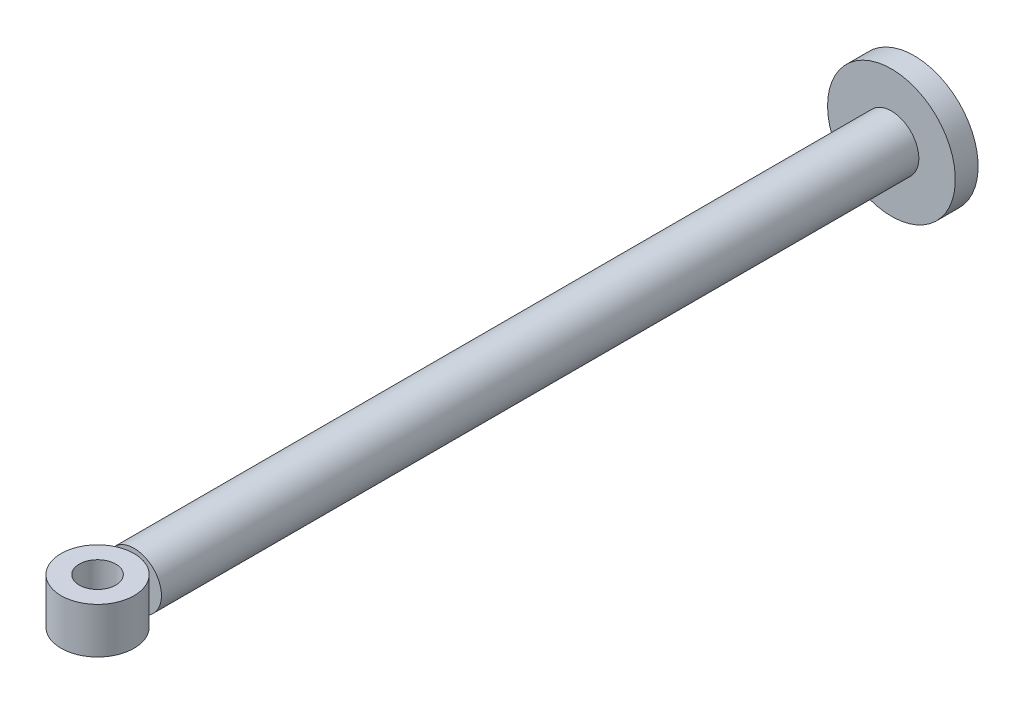
ISO-10303-21;
HEADER;
FILE_DESCRIPTION(('STEP AP214'),'2;1');
FILE_NAME('part.step','',(''),(''),'','','');
FILE_SCHEMA(('AUTOMOTIVE_DESIGN { 1 0 10303 214 1 1 1 1 }'));
ENDSEC;
DATA;
#1=APPLICATION_CONTEXT('core data for automotive mechanical design processes');
#2=APPLICATION_PROTOCOL_DEFINITION('international standard','automotive_design',2000,#1);
#3=PRODUCT_CONTEXT('',#1,'mechanical');
#4=PRODUCT('Part','Part','',(#3));
#5=PRODUCT_RELATED_PRODUCT_CATEGORY('part','',(#4));
#6=PRODUCT_DEFINITION_FORMATION('','',#4);
#7=PRODUCT_DEFINITION_CONTEXT('part definition',#1,'design');
#8=PRODUCT_DEFINITION('design','',#6,#7);
#9=PRODUCT_DEFINITION_SHAPE('','',#8);
#10=(LENGTH_UNIT() NAMED_UNIT(*) SI_UNIT(.MILLI.,.METRE.));
#11=(NAMED_UNIT(*) PLANE_ANGLE_UNIT() SI_UNIT($,.RADIAN.));
#12=(NAMED_UNIT(*) SI_UNIT($,.STERADIAN.) SOLID_ANGLE_UNIT());
#13=UNCERTAINTY_MEASURE_WITH_UNIT(LENGTH_MEASURE(1.E-05),#10,'distance_accuracy_value','');
#14=(GEOMETRIC_REPRESENTATION_CONTEXT(3) GLOBAL_UNCERTAINTY_ASSIGNED_CONTEXT((#13)) GLOBAL_UNIT_ASSIGNED_CONTEXT((#10,
#11,#12)) REPRESENTATION_CONTEXT('',''));
#15=CARTESIAN_POINT('',(0.,0.,0.));
#16=DIRECTION('',(0.,0.,1.));
#17=DIRECTION('',(1.,0.,0.));
#18=AXIS2_PLACEMENT_3D('',#15,#16,#17);
#19=CARTESIAN_POINT('',(0.,-2.5,89.5));
#20=DIRECTION('',(0.,1.,0.));
#21=DIRECTION('',(0.,0.,1.));
#22=AXIS2_PLACEMENT_3D('',#19,#20,#21);
#23=CYLINDRICAL_SURFACE('',#22,4.00000000000001);
#24=CARTESIAN_POINT('',(0.,-2.5,89.5));
#25=DIRECTION('',(0.,1.,0.));
#26=DIRECTION('',(0.,0.,1.));
#27=AXIS2_PLACEMENT_3D('',#24,#25,#26);
#28=CIRCLE('',#27,4.00000000000001);
#29=CARTESIAN_POINT('',(0.,-2.5,93.5));
#30=VERTEX_POINT('',#29);
#31=EDGE_CURVE('E11',#30,#30,#28,.T.);
#32=ORIENTED_EDGE('',*,*,#31,.T.);
#33=EDGE_LOOP('',(#32));
#34=FACE_BOUND('',#33,.T.);
#35=CARTESIAN_POINT('',(0.,2.5,89.5));
#36=DIRECTION('',(0.,1.,0.));
#37=DIRECTION('',(0.,0.,1.));
#38=AXIS2_PLACEMENT_3D('',#35,#36,#37);
#39=CIRCLE('',#38,4.00000000000001);
#40=CARTESIAN_POINT('',(0.,2.5,93.5));
#41=VERTEX_POINT('',#40);
#42=EDGE_CURVE('E55',#41,#41,#39,.T.);
#43=ORIENTED_EDGE('',*,*,#42,.F.);
#44=EDGE_LOOP('',(#43));
#45=FACE_BOUND('',#44,.T.);
#46=ADVANCED_FACE('F45',(#34,#45),#23,.T.);
#47=CARTESIAN_POINT('',(0.,-2.5,89.5));
#48=DIRECTION('',(0.,1.,0.));
#49=DIRECTION('',(0.,0.,1.));
#50=AXIS2_PLACEMENT_3D('',#47,#48,#49);
#51=PLANE('',#50);
#52=CARTESIAN_POINT('',(0.,-2.5,89.5));
#53=DIRECTION('',(0.,1.,0.));
#54=DIRECTION('',(0.,0.,1.));
#55=AXIS2_PLACEMENT_3D('',#52,#53,#54);
#56=CIRCLE('',#55,2.);
#57=CARTESIAN_POINT('',(0.,-2.5,91.5));
#58=VERTEX_POINT('',#57);
#59=EDGE_CURVE('E51',#58,#58,#56,.T.);
#60=ORIENTED_EDGE('',*,*,#59,.T.);
#61=EDGE_LOOP('',(#60));
#62=FACE_BOUND('',#61,.T.);
#63=ORIENTED_EDGE('',*,*,#31,.F.);
#64=EDGE_LOOP('',(#63));
#65=FACE_BOUND('',#64,.T.);
#66=ADVANCED_FACE('F74',(#62,#65),#51,.F.);
#67=CARTESIAN_POINT('',(0.,-2.5,89.5));
#68=DIRECTION('',(0.,1.,0.));
#69=DIRECTION('',(0.,0.,1.));
#70=AXIS2_PLACEMENT_3D('',#67,#68,#69);
#71=CYLINDRICAL_SURFACE('',#70,2.);
#72=ORIENTED_EDGE('',*,*,#59,.F.);
#73=EDGE_LOOP('',(#72));
#74=FACE_BOUND('',#73,.T.);
#75=CARTESIAN_POINT('',(0.,2.5,89.5));
#76=DIRECTION('',(0.,1.,0.));
#77=DIRECTION('',(0.,0.,1.));
#78=AXIS2_PLACEMENT_3D('',#75,#76,#77);
#79=CIRCLE('',#78,2.);
#80=CARTESIAN_POINT('',(0.,2.5,91.5));
#81=VERTEX_POINT('',#80);
#82=EDGE_CURVE('E59',#81,#81,#79,.T.);
#83=ORIENTED_EDGE('',*,*,#82,.T.);
#84=EDGE_LOOP('',(#83));
#85=FACE_BOUND('',#84,.T.);
#86=ADVANCED_FACE('F65',(#74,#85),#71,.F.);
#87=CARTESIAN_POINT('',(0.,2.5,89.5));
#88=DIRECTION('',(0.,1.,0.));
#89=DIRECTION('',(0.,0.,1.));
#90=AXIS2_PLACEMENT_3D('',#87,#88,#89);
#91=PLANE('',#90);
#92=ORIENTED_EDGE('',*,*,#42,.T.);
#93=EDGE_LOOP('',(#92));
#94=FACE_BOUND('',#93,.T.);
#95=ORIENTED_EDGE('',*,*,#82,.F.);
#96=EDGE_LOOP('',(#95));
#97=FACE_BOUND('',#96,.T.);
#98=ADVANCED_FACE('F67',(#94,#97),#91,.T.);
#99=CLOSED_SHELL('',(#46,#66,#86,#98));
#100=MANIFOLD_SOLID_BREP('B2',#99);
#101=CARTESIAN_POINT('',(0.,0.,85.5));
#102=DIRECTION('',(0.,0.,-1.));
#103=DIRECTION('',(-1.,0.,0.));
#104=AXIS2_PLACEMENT_3D('',#101,#102,#103);
#105=CYLINDRICAL_SURFACE('',#104,3.);
#106=CARTESIAN_POINT('',(0.,0.,85.5));
#107=DIRECTION('',(0.,0.,1.));
#108=DIRECTION('',(1.,0.,0.));
#109=AXIS2_PLACEMENT_3D('',#106,#107,#108);
#110=CIRCLE('',#109,3.);
#111=CARTESIAN_POINT('',(3.,0.,85.5));
#112=VERTEX_POINT('',#111);
#113=EDGE_CURVE('E114',#112,#112,#110,.T.);
#114=ORIENTED_EDGE('',*,*,#113,.F.);
#115=EDGE_LOOP('',(#114));
#116=FACE_BOUND('',#115,.T.);
#117=CARTESIAN_POINT('',(0.,0.,2.5));
#118=DIRECTION('',(0.,0.,-1.));
#119=DIRECTION('',(-1.,0.,0.));
#120=AXIS2_PLACEMENT_3D('',#117,#118,#119);
#121=CIRCLE('',#120,3.);
#122=CARTESIAN_POINT('',(-3.,0.,2.5));
#123=VERTEX_POINT('',#122);
#124=EDGE_CURVE('E44',#123,#123,#121,.T.);
#125=ORIENTED_EDGE('',*,*,#124,.F.);
#126=EDGE_LOOP('',(#125));
#127=FACE_BOUND('',#126,.T.);
#128=ADVANCED_FACE('F107',(#116,#127),#105,.T.);
#129=CARTESIAN_POINT('',(0.,0.,85.5));
#130=DIRECTION('',(0.,0.,1.));
#131=DIRECTION('',(1.,0.,0.));
#132=AXIS2_PLACEMENT_3D('',#129,#130,#131);
#133=PLANE('',#132);
#134=ORIENTED_EDGE('',*,*,#113,.T.);
#135=EDGE_LOOP('',(#134));
#136=FACE_BOUND('',#135,.T.);
#137=ADVANCED_FACE('F136',(#136),#133,.T.);
#138=CARTESIAN_POINT('',(0.,0.,2.5));
#139=DIRECTION('',(0.,0.,-1.));
#140=DIRECTION('',(-1.,0.,0.));
#141=AXIS2_PLACEMENT_3D('',#138,#139,#140);
#142=CYLINDRICAL_SURFACE('',#141,7.);
#143=CARTESIAN_POINT('',(0.,0.,2.5));
#144=DIRECTION('',(0.,0.,-1.));
#145=DIRECTION('',(-1.,0.,0.));
#146=AXIS2_PLACEMENT_3D('',#143,#144,#145);
#147=CIRCLE('',#146,7.);
#148=CARTESIAN_POINT('',(-7.,0.,2.5));
#149=VERTEX_POINT('',#148);
#150=EDGE_CURVE('E119',#149,#149,#147,.T.);
#151=ORIENTED_EDGE('',*,*,#150,.T.);
#152=EDGE_LOOP('',(#151));
#153=FACE_BOUND('',#152,.T.);
#154=CARTESIAN_POINT('',(0.,0.,0.));
#155=DIRECTION('',(0.,0.,-1.));
#156=DIRECTION('',(-1.,0.,0.));
#157=AXIS2_PLACEMENT_3D('',#154,#155,#156);
#158=CIRCLE('',#157,7.);
#159=CARTESIAN_POINT('',(-7.,0.,0.));
#160=VERTEX_POINT('',#159);
#161=EDGE_CURVE('E124',#160,#160,#158,.T.);
#162=ORIENTED_EDGE('',*,*,#161,.F.);
#163=EDGE_LOOP('',(#162));
#164=FACE_BOUND('',#163,.T.);
#165=ADVANCED_FACE('F133',(#153,#164),#142,.T.);
#166=CARTESIAN_POINT('',(0.,0.,2.5));
#167=DIRECTION('',(0.,0.,-1.));
#168=DIRECTION('',(-1.,0.,0.));
#169=AXIS2_PLACEMENT_3D('',#166,#167,#168);
#170=PLANE('',#169);
#171=ORIENTED_EDGE('',*,*,#124,.T.);
#172=EDGE_LOOP('',(#171));
#173=FACE_BOUND('',#172,.T.);
#174=ORIENTED_EDGE('',*,*,#150,.F.);
#175=EDGE_LOOP('',(#174));
#176=FACE_BOUND('',#175,.T.);
#177=ADVANCED_FACE('F135',(#173,#176),#170,.F.);
#178=CARTESIAN_POINT('',(0.,0.,0.));
#179=DIRECTION('',(0.,0.,1.));
#180=DIRECTION('',(1.,0.,0.));
#181=AXIS2_PLACEMENT_3D('',#178,#179,#180);
#182=PLANE('',#181);
#183=ORIENTED_EDGE('',*,*,#161,.T.);
#184=EDGE_LOOP('',(#183));
#185=FACE_BOUND('',#184,.T.);
#186=ADVANCED_FACE('F131',(#185),#182,.F.);
#187=CLOSED_SHELL('',(#128,#137,#165,#177,#186));
#188=MANIFOLD_SOLID_BREP('B6',#187);
#189=ADVANCED_BREP_SHAPE_REPRESENTATION('',(#18,#100,#188),#14);
#190=SHAPE_DEFINITION_REPRESENTATION(#9,#189);
ENDSEC;
END-ISO-10303-21;
